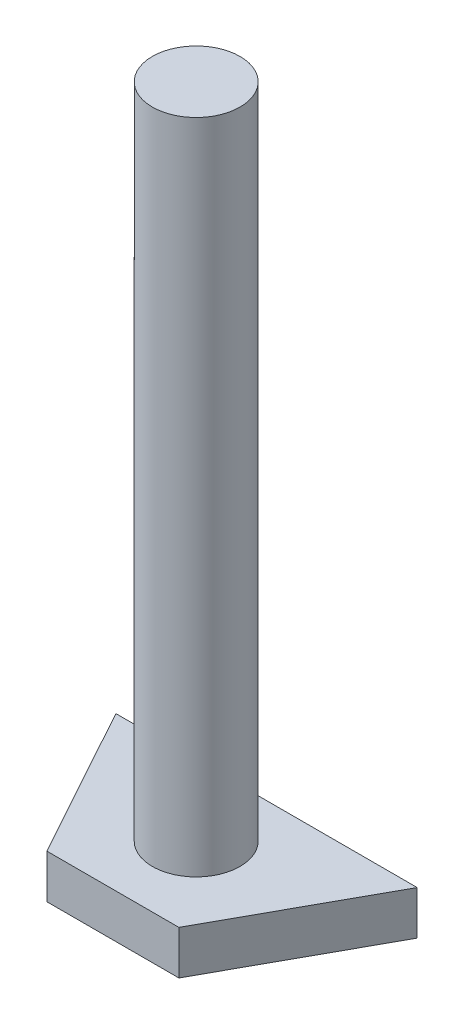
ISO-10303-21;
HEADER;
FILE_DESCRIPTION(('STEP AP214'),'2;1');
FILE_NAME('part.step','',(''),(''),'','','');
FILE_SCHEMA(('AUTOMOTIVE_DESIGN { 1 0 10303 214 1 1 1 1 }'));
ENDSEC;
DATA;
#1=APPLICATION_CONTEXT('core data for automotive mechanical design processes');
#2=APPLICATION_PROTOCOL_DEFINITION('international standard','automotive_design',2000,#1);
#3=PRODUCT_CONTEXT('',#1,'mechanical');
#4=PRODUCT('Part','Part','',(#3));
#5=PRODUCT_RELATED_PRODUCT_CATEGORY('part','',(#4));
#6=PRODUCT_DEFINITION_FORMATION('','',#4);
#7=PRODUCT_DEFINITION_CONTEXT('part definition',#1,'design');
#8=PRODUCT_DEFINITION('design','',#6,#7);
#9=PRODUCT_DEFINITION_SHAPE('','',#8);
#10=(LENGTH_UNIT() NAMED_UNIT(*) SI_UNIT(.MILLI.,.METRE.));
#11=(NAMED_UNIT(*) PLANE_ANGLE_UNIT() SI_UNIT($,.RADIAN.));
#12=(NAMED_UNIT(*) SI_UNIT($,.STERADIAN.) SOLID_ANGLE_UNIT());
#13=UNCERTAINTY_MEASURE_WITH_UNIT(LENGTH_MEASURE(1.E-05),#10,'distance_accuracy_value','');
#14=(GEOMETRIC_REPRESENTATION_CONTEXT(3) GLOBAL_UNCERTAINTY_ASSIGNED_CONTEXT((#13)) GLOBAL_UNIT_ASSIGNED_CONTEXT((#10,
#11,#12)) REPRESENTATION_CONTEXT('',''));
#15=CARTESIAN_POINT('',(0.,0.,0.));
#16=DIRECTION('',(0.,0.,1.));
#17=DIRECTION('',(1.,0.,0.));
#18=AXIS2_PLACEMENT_3D('',#15,#16,#17);
#19=CARTESIAN_POINT('',(76.5581143353984,30.,-38.393702022006));
#20=DIRECTION('',(0.,-1.,0.));
#21=DIRECTION('',(0.,0.,-1.));
#22=AXIS2_PLACEMENT_3D('',#19,#20,#21);
#23=CYLINDRICAL_SURFACE('',#22,2.);
#24=CARTESIAN_POINT('',(76.5581143353984,30.,-38.393702022006));
#25=DIRECTION('',(0.,1.,0.));
#26=DIRECTION('',(0.,0.,1.));
#27=AXIS2_PLACEMENT_3D('',#24,#25,#26);
#28=CIRCLE('',#27,2.);
#29=CARTESIAN_POINT('',(76.5581143353984,30.,-36.393702022006));
#30=VERTEX_POINT('',#29);
#31=EDGE_CURVE('E11',#30,#30,#28,.T.);
#32=ORIENTED_EDGE('',*,*,#31,.F.);
#33=EDGE_LOOP('',(#32));
#34=FACE_BOUND('',#33,.T.);
#35=CARTESIAN_POINT('',(76.5581143353984,0.,-38.393702022006));
#36=DIRECTION('',(0.,-1.,0.));
#37=DIRECTION('',(0.,0.,-1.));
#38=AXIS2_PLACEMENT_3D('',#35,#36,#37);
#39=CIRCLE('',#38,2.);
#40=CARTESIAN_POINT('',(76.5581143353984,0.,-40.393702022006));
#41=VERTEX_POINT('',#40);
#42=EDGE_CURVE('E44',#41,#41,#39,.T.);
#43=ORIENTED_EDGE('',*,*,#42,.F.);
#44=EDGE_LOOP('',(#43));
#45=FACE_BOUND('',#44,.T.);
#46=ADVANCED_FACE('F36',(#34,#45),#23,.T.);
#47=CARTESIAN_POINT('',(76.5581143353984,30.,-38.393702022006));
#48=DIRECTION('',(0.,1.,0.));
#49=DIRECTION('',(0.,0.,1.));
#50=AXIS2_PLACEMENT_3D('',#47,#48,#49);
#51=PLANE('',#50);
#52=ORIENTED_EDGE('',*,*,#31,.T.);
#53=EDGE_LOOP('',(#52));
#54=FACE_BOUND('',#53,.T.);
#55=ADVANCED_FACE('F117',(#54),#51,.T.);
#56=CARTESIAN_POINT('',(0.,0.,0.));
#57=DIRECTION('',(0.,-1.,0.));
#58=DIRECTION('',(0.,0.,-1.));
#59=AXIS2_PLACEMENT_3D('',#56,#57,#58);
#60=PLANE('',#59);
#61=DIRECTION('',(-0.48238510438158,0.,-0.875959251946557));
#62=VECTOR('',#61,1.);
#63=CARTESIAN_POINT('',(73.5463027998182,0.,-34.5947427463331));
#64=LINE('',#63,#62);
#65=CARTESIAN_POINT('',(73.5463027998182,0.,-34.5947427463331));
#66=VERTEX_POINT('',#65);
#67=CARTESIAN_POINT('',(69.6872219647655,0.,-41.6024167619056));
#68=VERTEX_POINT('',#67);
#69=EDGE_CURVE('E103',#66,#68,#64,.T.);
#70=ORIENTED_EDGE('',*,*,#69,.F.);
#71=DIRECTION('',(-1.,0.,0.));
#72=VECTOR('',#71,1.);
#73=CARTESIAN_POINT('',(79.5699258709786,0.,-34.5947427463331));
#74=LINE('',#73,#72);
#75=CARTESIAN_POINT('',(79.5699258709786,0.,-34.5947427463331));
#76=VERTEX_POINT('',#75);
#77=EDGE_CURVE('E75',#76,#66,#74,.T.);
#78=ORIENTED_EDGE('',*,*,#77,.F.);
#79=DIRECTION('',(-0.48238510438158,0.,0.875959251946557));
#80=VECTOR('',#79,1.);
#81=CARTESIAN_POINT('',(79.5699258709786,0.,-34.5947427463331));
#82=LINE('',#81,#80);
#83=CARTESIAN_POINT('',(83.4290067060313,0.,-41.6024167619056));
#84=VERTEX_POINT('',#83);
#85=EDGE_CURVE('E69',#84,#76,#82,.T.);
#86=ORIENTED_EDGE('',*,*,#85,.F.);
#87=DIRECTION('',(1.,0.,0.));
#88=VECTOR('',#87,1.);
#89=CARTESIAN_POINT('',(69.6872219647655,0.,-41.6024167619056));
#90=LINE('',#89,#88);
#91=EDGE_CURVE('E93',#68,#84,#90,.T.);
#92=ORIENTED_EDGE('',*,*,#91,.F.);
#93=EDGE_LOOP('',(#70,#78,#86,#92));
#94=FACE_BOUND('',#93,.T.);
#95=ORIENTED_EDGE('',*,*,#42,.T.);
#96=EDGE_LOOP('',(#95));
#97=FACE_BOUND('',#96,.T.);
#98=ADVANCED_FACE('F114',(#94,#97),#60,.F.);
#99=CARTESIAN_POINT('',(73.5463027998182,-2.,-34.5947427463331));
#100=DIRECTION('',(0.875959251946557,0.,-0.48238510438158));
#101=DIRECTION('',(-0.48238510438158,0.,-0.875959251946557));
#102=AXIS2_PLACEMENT_3D('',#99,#100,#101);
#103=PLANE('',#102);
#104=ORIENTED_EDGE('',*,*,#69,.T.);
#105=DIRECTION('',(0.,1.,0.));
#106=VECTOR('',#105,1.);
#107=CARTESIAN_POINT('',(69.6872219647655,-2.,-41.6024167619056));
#108=LINE('',#107,#106);
#109=CARTESIAN_POINT('',(69.6872219647655,-2.,-41.6024167619056));
#110=VERTEX_POINT('',#109);
#111=EDGE_CURVE('E94',#110,#68,#108,.T.);
#112=ORIENTED_EDGE('',*,*,#111,.F.);
#113=DIRECTION('',(-0.48238510438158,0.,-0.875959251946557));
#114=VECTOR('',#113,1.);
#115=CARTESIAN_POINT('',(73.5463027998182,-2.,-34.5947427463331));
#116=LINE('',#115,#114);
#117=CARTESIAN_POINT('',(73.5463027998182,-2.,-34.5947427463331));
#118=VERTEX_POINT('',#117);
#119=EDGE_CURVE('E88',#118,#110,#116,.T.);
#120=ORIENTED_EDGE('',*,*,#119,.F.);
#121=DIRECTION('',(0.,1.,0.));
#122=VECTOR('',#121,1.);
#123=CARTESIAN_POINT('',(73.5463027998182,-2.,-34.5947427463331));
#124=LINE('',#123,#122);
#125=EDGE_CURVE('E99',#118,#66,#124,.T.);
#126=ORIENTED_EDGE('',*,*,#125,.T.);
#127=EDGE_LOOP('',(#104,#112,#120,#126));
#128=FACE_BOUND('',#127,.T.);
#129=ADVANCED_FACE('F127',(#128),#103,.F.);
#130=CARTESIAN_POINT('',(69.6872219647655,-2.,-41.6024167619056));
#131=DIRECTION('',(0.,0.,1.));
#132=DIRECTION('',(1.,0.,0.));
#133=AXIS2_PLACEMENT_3D('',#130,#131,#132);
#134=PLANE('',#133);
#135=ORIENTED_EDGE('',*,*,#91,.T.);
#136=DIRECTION('',(0.,1.,0.));
#137=VECTOR('',#136,1.);
#138=CARTESIAN_POINT('',(83.4290067060313,-2.,-41.6024167619056));
#139=LINE('',#138,#137);
#140=CARTESIAN_POINT('',(83.4290067060313,-2.,-41.6024167619056));
#141=VERTEX_POINT('',#140);
#142=EDGE_CURVE('E91',#141,#84,#139,.T.);
#143=ORIENTED_EDGE('',*,*,#142,.F.);
#144=DIRECTION('',(1.,0.,0.));
#145=VECTOR('',#144,1.);
#146=CARTESIAN_POINT('',(69.6872219647655,-2.,-41.6024167619056));
#147=LINE('',#146,#145);
#148=EDGE_CURVE('E83',#110,#141,#147,.T.);
#149=ORIENTED_EDGE('',*,*,#148,.F.);
#150=ORIENTED_EDGE('',*,*,#111,.T.);
#151=EDGE_LOOP('',(#135,#143,#149,#150));
#152=FACE_BOUND('',#151,.T.);
#153=ADVANCED_FACE('F92',(#152),#134,.F.);
#154=CARTESIAN_POINT('',(79.5699258709786,-2.,-34.5947427463331));
#155=DIRECTION('',(-0.875959251946557,0.,-0.48238510438158));
#156=DIRECTION('',(-0.48238510438158,0.,0.875959251946557));
#157=AXIS2_PLACEMENT_3D('',#154,#155,#156);
#158=PLANE('',#157);
#159=ORIENTED_EDGE('',*,*,#85,.T.);
#160=DIRECTION('',(0.,1.,0.));
#161=VECTOR('',#160,1.);
#162=CARTESIAN_POINT('',(79.5699258709786,-2.,-34.5947427463331));
#163=LINE('',#162,#161);
#164=CARTESIAN_POINT('',(79.5699258709786,-2.,-34.5947427463331));
#165=VERTEX_POINT('',#164);
#166=EDGE_CURVE('E95',#165,#76,#163,.T.);
#167=ORIENTED_EDGE('',*,*,#166,.F.);
#168=DIRECTION('',(-0.48238510438158,0.,0.875959251946557));
#169=VECTOR('',#168,1.);
#170=CARTESIAN_POINT('',(79.5699258709786,-2.,-34.5947427463331));
#171=LINE('',#170,#169);
#172=EDGE_CURVE('E86',#141,#165,#171,.T.);
#173=ORIENTED_EDGE('',*,*,#172,.F.);
#174=ORIENTED_EDGE('',*,*,#142,.T.);
#175=EDGE_LOOP('',(#159,#167,#173,#174));
#176=FACE_BOUND('',#175,.T.);
#177=ADVANCED_FACE('F97',(#176),#158,.F.);
#178=CARTESIAN_POINT('',(79.5699258709786,-2.,-34.5947427463331));
#179=DIRECTION('',(0.,0.,-1.));
#180=DIRECTION('',(-1.,0.,0.));
#181=AXIS2_PLACEMENT_3D('',#178,#179,#180);
#182=PLANE('',#181);
#183=ORIENTED_EDGE('',*,*,#77,.T.);
#184=ORIENTED_EDGE('',*,*,#125,.F.);
#185=DIRECTION('',(-1.,0.,0.));
#186=VECTOR('',#185,1.);
#187=CARTESIAN_POINT('',(79.5699258709786,-2.,-34.5947427463331));
#188=LINE('',#187,#186);
#189=EDGE_CURVE('E52',#165,#118,#188,.T.);
#190=ORIENTED_EDGE('',*,*,#189,.F.);
#191=ORIENTED_EDGE('',*,*,#166,.T.);
#192=EDGE_LOOP('',(#183,#184,#190,#191));
#193=FACE_BOUND('',#192,.T.);
#194=ADVANCED_FACE('F138',(#193),#182,.F.);
#195=CARTESIAN_POINT('',(0.,-2.,0.));
#196=DIRECTION('',(0.,-1.,0.));
#197=DIRECTION('',(0.,0.,-1.));
#198=AXIS2_PLACEMENT_3D('',#195,#196,#197);
#199=PLANE('',#198);
#200=ORIENTED_EDGE('',*,*,#119,.T.);
#201=ORIENTED_EDGE('',*,*,#148,.T.);
#202=ORIENTED_EDGE('',*,*,#172,.T.);
#203=ORIENTED_EDGE('',*,*,#189,.T.);
#204=EDGE_LOOP('',(#200,#201,#202,#203));
#205=FACE_BOUND('',#204,.T.);
#206=ADVANCED_FACE('F84',(#205),#199,.T.);
#207=CLOSED_SHELL('',(#46,#55,#98,#129,#153,#177,#194,#206));
#208=MANIFOLD_SOLID_BREP('B2',#207);
#209=ADVANCED_BREP_SHAPE_REPRESENTATION('',(#18,#208),#14);
#210=SHAPE_DEFINITION_REPRESENTATION(#9,#209);
ENDSEC;
END-ISO-10303-21;
